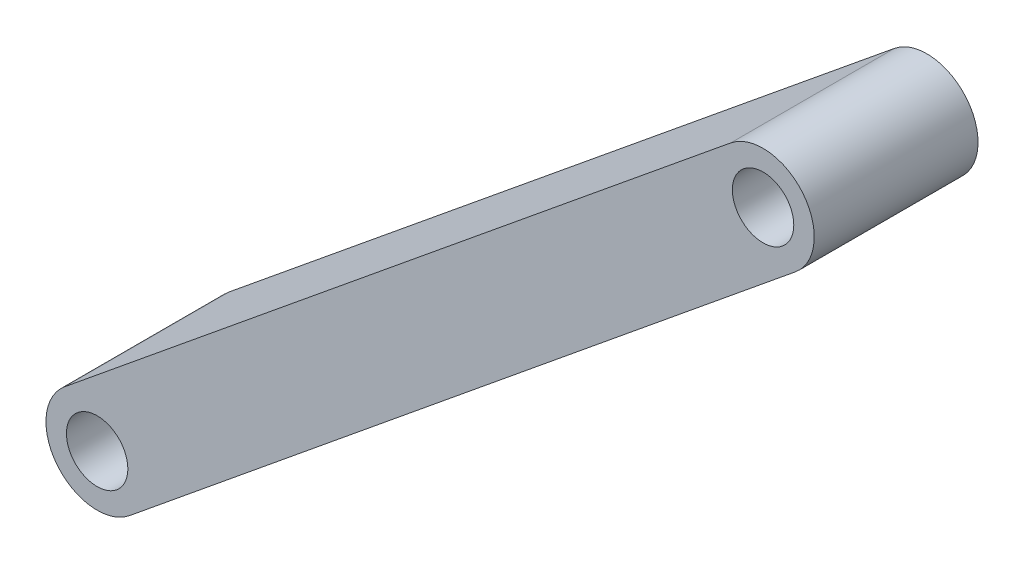
ISO-10303-21;
HEADER;
FILE_DESCRIPTION(('STEP AP214'),'2;1');
FILE_NAME('part.step','',(''),(''),'','','');
FILE_SCHEMA(('AUTOMOTIVE_DESIGN { 1 0 10303 214 1 1 1 1 }'));
ENDSEC;
DATA;
#1=APPLICATION_CONTEXT('core data for automotive mechanical design processes');
#2=APPLICATION_PROTOCOL_DEFINITION('international standard','automotive_design',2000,#1);
#3=PRODUCT_CONTEXT('',#1,'mechanical');
#4=PRODUCT('Part','Part','',(#3));
#5=PRODUCT_RELATED_PRODUCT_CATEGORY('part','',(#4));
#6=PRODUCT_DEFINITION_FORMATION('','',#4);
#7=PRODUCT_DEFINITION_CONTEXT('part definition',#1,'design');
#8=PRODUCT_DEFINITION('design','',#6,#7);
#9=PRODUCT_DEFINITION_SHAPE('','',#8);
#10=(LENGTH_UNIT() NAMED_UNIT(*) SI_UNIT(.MILLI.,.METRE.));
#11=(NAMED_UNIT(*) PLANE_ANGLE_UNIT() SI_UNIT($,.RADIAN.));
#12=(NAMED_UNIT(*) SI_UNIT($,.STERADIAN.) SOLID_ANGLE_UNIT());
#13=UNCERTAINTY_MEASURE_WITH_UNIT(LENGTH_MEASURE(1.E-05),#10,'distance_accuracy_value','');
#14=(GEOMETRIC_REPRESENTATION_CONTEXT(3) GLOBAL_UNCERTAINTY_ASSIGNED_CONTEXT((#13)) GLOBAL_UNIT_ASSIGNED_CONTEXT((#10,
#11,#12)) REPRESENTATION_CONTEXT('',''));
#15=CARTESIAN_POINT('',(0.,0.,0.));
#16=DIRECTION('',(0.,0.,1.));
#17=DIRECTION('',(1.,0.,0.));
#18=AXIS2_PLACEMENT_3D('',#15,#16,#17);
#19=CARTESIAN_POINT('',(-27.9562742549118,16.5739774883447,4.));
#20=DIRECTION('',(0.,0.,1.));
#21=DIRECTION('',(1.,0.,0.));
#22=AXIS2_PLACEMENT_3D('',#19,#20,#21);
#23=PLANE('',#22);
#24=CARTESIAN_POINT('',(-27.9562742549118,16.5739774883447,4.));
#25=DIRECTION('',(0.,0.,1.));
#26=DIRECTION('',(1.,0.,0.));
#27=AXIS2_PLACEMENT_3D('',#24,#25,#26);
#28=CIRCLE('',#27,1.5);
#29=CARTESIAN_POINT('',(-26.4562742549118,16.5739774883447,4.));
#30=VERTEX_POINT('',#29);
#31=EDGE_CURVE('E108',#30,#30,#28,.T.);
#32=ORIENTED_EDGE('',*,*,#31,.F.);
#33=EDGE_LOOP('',(#32));
#34=FACE_BOUND('',#33,.T.);
#35=CARTESIAN_POINT('',(-27.9562742549118,16.5739774883447,4.));
#36=DIRECTION('',(0.,0.,1.));
#37=DIRECTION('',(1.,0.,0.));
#38=AXIS2_PLACEMENT_3D('',#35,#36,#37);
#39=CIRCLE('',#38,2.50000000000001);
#40=CARTESIAN_POINT('',(-26.3744898806056,14.6380130792708,4.));
#41=VERTEX_POINT('',#40);
#42=CARTESIAN_POINT('',(-29.538058629218,18.5099418974185,4.));
#43=VERTEX_POINT('',#42);
#44=EDGE_CURVE('E93',#41,#43,#39,.T.);
#45=ORIENTED_EDGE('',*,*,#44,.T.);
#46=DIRECTION('',(-0.774385763629539,-0.632713749722492,0.));
#47=VECTOR('',#46,1.);
#48=CARTESIAN_POINT('',(-29.538058629218,18.5099418974185,4.));
#49=LINE('',#48,#47);
#50=CARTESIAN_POINT('',(-62.0622607016587,-8.06403559092615,4.));
#51=VERTEX_POINT('',#50);
#52=EDGE_CURVE('E88',#43,#51,#49,.T.);
#53=ORIENTED_EDGE('',*,*,#52,.T.);
#54=CARTESIAN_POINT('',(-60.4804763273524,-10.,4.));
#55=DIRECTION('',(0.,0.,1.));
#56=DIRECTION('',(1.,0.,0.));
#57=AXIS2_PLACEMENT_3D('',#54,#55,#56);
#58=CIRCLE('',#57,2.50000000000001);
#59=CARTESIAN_POINT('',(-58.8986919530462,-11.9359644090739,4.));
#60=VERTEX_POINT('',#59);
#61=EDGE_CURVE('E91',#51,#60,#58,.T.);
#62=ORIENTED_EDGE('',*,*,#61,.T.);
#63=DIRECTION('',(0.774385763629539,0.632713749722492,0.));
#64=VECTOR('',#63,1.);
#65=CARTESIAN_POINT('',(-26.3744898806056,14.6380130792708,4.));
#66=LINE('',#65,#64);
#67=EDGE_CURVE('E58',#60,#41,#66,.T.);
#68=ORIENTED_EDGE('',*,*,#67,.T.);
#69=EDGE_LOOP('',(#45,#53,#62,#68));
#70=FACE_BOUND('',#69,.T.);
#71=CARTESIAN_POINT('',(-60.4804763273524,-10.,4.));
#72=DIRECTION('',(0.,0.,1.));
#73=DIRECTION('',(1.,0.,0.));
#74=AXIS2_PLACEMENT_3D('',#71,#72,#73);
#75=CIRCLE('',#74,1.5);
#76=CARTESIAN_POINT('',(-58.9804763273524,-10.,4.));
#77=VERTEX_POINT('',#76);
#78=EDGE_CURVE('E123',#77,#77,#75,.T.);
#79=ORIENTED_EDGE('',*,*,#78,.F.);
#80=EDGE_LOOP('',(#79));
#81=FACE_BOUND('',#80,.T.);
#82=ADVANCED_FACE('F41',(#34,#70,#81),#23,.T.);
#83=CARTESIAN_POINT('',(-27.9562742549118,16.5739774883447,-4.));
#84=DIRECTION('',(0.,0.,1.));
#85=DIRECTION('',(1.,0.,0.));
#86=AXIS2_PLACEMENT_3D('',#83,#84,#85);
#87=PLANE('',#86);
#88=CARTESIAN_POINT('',(-27.9562742549118,16.5739774883447,-4.));
#89=DIRECTION('',(0.,0.,1.));
#90=DIRECTION('',(1.,0.,0.));
#91=AXIS2_PLACEMENT_3D('',#88,#89,#90);
#92=CIRCLE('',#91,2.50000000000001);
#93=CARTESIAN_POINT('',(-26.3744898806056,14.6380130792708,-4.));
#94=VERTEX_POINT('',#93);
#95=CARTESIAN_POINT('',(-29.538058629218,18.5099418974185,-4.));
#96=VERTEX_POINT('',#95);
#97=EDGE_CURVE('E105',#94,#96,#92,.T.);
#98=ORIENTED_EDGE('',*,*,#97,.F.);
#99=DIRECTION('',(0.774385763629539,0.632713749722492,0.));
#100=VECTOR('',#99,1.);
#101=CARTESIAN_POINT('',(-26.3744898806056,14.6380130792708,-4.));
#102=LINE('',#101,#100);
#103=CARTESIAN_POINT('',(-58.8986919530462,-11.9359644090739,-4.));
#104=VERTEX_POINT('',#103);
#105=EDGE_CURVE('E81',#104,#94,#102,.T.);
#106=ORIENTED_EDGE('',*,*,#105,.F.);
#107=CARTESIAN_POINT('',(-60.4804763273524,-10.,-4.));
#108=DIRECTION('',(0.,0.,1.));
#109=DIRECTION('',(1.,0.,0.));
#110=AXIS2_PLACEMENT_3D('',#107,#108,#109);
#111=CIRCLE('',#110,2.50000000000001);
#112=CARTESIAN_POINT('',(-62.0622607016587,-8.06403559092615,-4.));
#113=VERTEX_POINT('',#112);
#114=EDGE_CURVE('E75',#113,#104,#111,.T.);
#115=ORIENTED_EDGE('',*,*,#114,.F.);
#116=DIRECTION('',(-0.774385763629539,-0.632713749722492,0.));
#117=VECTOR('',#116,1.);
#118=CARTESIAN_POINT('',(-29.538058629218,18.5099418974185,-4.));
#119=LINE('',#118,#117);
#120=EDGE_CURVE('E97',#96,#113,#119,.T.);
#121=ORIENTED_EDGE('',*,*,#120,.F.);
#122=EDGE_LOOP('',(#98,#106,#115,#121));
#123=FACE_BOUND('',#122,.T.);
#124=CARTESIAN_POINT('',(-27.9562742549118,16.5739774883447,-4.));
#125=DIRECTION('',(0.,0.,1.));
#126=DIRECTION('',(1.,0.,0.));
#127=AXIS2_PLACEMENT_3D('',#124,#125,#126);
#128=CIRCLE('',#127,1.5);
#129=CARTESIAN_POINT('',(-26.4562742549118,16.5739774883447,-4.));
#130=VERTEX_POINT('',#129);
#131=EDGE_CURVE('E120',#130,#130,#128,.T.);
#132=ORIENTED_EDGE('',*,*,#131,.T.);
#133=EDGE_LOOP('',(#132));
#134=FACE_BOUND('',#133,.T.);
#135=CARTESIAN_POINT('',(-60.4804763273524,-10.,-4.));
#136=DIRECTION('',(0.,0.,1.));
#137=DIRECTION('',(1.,0.,0.));
#138=AXIS2_PLACEMENT_3D('',#135,#136,#137);
#139=CIRCLE('',#138,1.5);
#140=CARTESIAN_POINT('',(-58.9804763273524,-10.,-4.));
#141=VERTEX_POINT('',#140);
#142=EDGE_CURVE('E126',#141,#141,#139,.T.);
#143=ORIENTED_EDGE('',*,*,#142,.T.);
#144=EDGE_LOOP('',(#143));
#145=FACE_BOUND('',#144,.T.);
#146=ADVANCED_FACE('F116',(#123,#134,#145),#87,.F.);
#147=CARTESIAN_POINT('',(-27.9562742549118,16.5739774883447,4.));
#148=DIRECTION('',(0.,0.,-1.));
#149=DIRECTION('',(-1.,0.,0.));
#150=AXIS2_PLACEMENT_3D('',#147,#148,#149);
#151=CYLINDRICAL_SURFACE('',#150,2.50000000000001);
#152=ORIENTED_EDGE('',*,*,#97,.T.);
#153=DIRECTION('',(0.,0.,-1.));
#154=VECTOR('',#153,1.);
#155=CARTESIAN_POINT('',(-29.538058629218,18.5099418974185,4.));
#156=LINE('',#155,#154);
#157=EDGE_CURVE('E11',#43,#96,#156,.T.);
#158=ORIENTED_EDGE('',*,*,#157,.F.);
#159=ORIENTED_EDGE('',*,*,#44,.F.);
#160=DIRECTION('',(0.,0.,-1.));
#161=VECTOR('',#160,1.);
#162=CARTESIAN_POINT('',(-26.3744898806056,14.6380130792708,4.));
#163=LINE('',#162,#161);
#164=EDGE_CURVE('E101',#41,#94,#163,.T.);
#165=ORIENTED_EDGE('',*,*,#164,.T.);
#166=EDGE_LOOP('',(#152,#158,#159,#165));
#167=FACE_BOUND('',#166,.T.);
#168=ADVANCED_FACE('F43',(#167),#151,.T.);
#169=CARTESIAN_POINT('',(-29.538058629218,18.5099418974185,4.));
#170=DIRECTION('',(0.632713749722492,-0.774385763629539,0.));
#171=DIRECTION('',(0.774385763629539,0.632713749722492,0.));
#172=AXIS2_PLACEMENT_3D('',#169,#170,#171);
#173=PLANE('',#172);
#174=ORIENTED_EDGE('',*,*,#120,.T.);
#175=DIRECTION('',(0.,0.,-1.));
#176=VECTOR('',#175,1.);
#177=CARTESIAN_POINT('',(-62.0622607016587,-8.06403559092615,4.));
#178=LINE('',#177,#176);
#179=EDGE_CURVE('E50',#51,#113,#178,.T.);
#180=ORIENTED_EDGE('',*,*,#179,.F.);
#181=ORIENTED_EDGE('',*,*,#52,.F.);
#182=ORIENTED_EDGE('',*,*,#157,.T.);
#183=EDGE_LOOP('',(#174,#180,#181,#182));
#184=FACE_BOUND('',#183,.T.);
#185=ADVANCED_FACE('F96',(#184),#173,.F.);
#186=CARTESIAN_POINT('',(-60.4804763273524,-10.,4.));
#187=DIRECTION('',(0.,0.,-1.));
#188=DIRECTION('',(-1.,0.,0.));
#189=AXIS2_PLACEMENT_3D('',#186,#187,#188);
#190=CYLINDRICAL_SURFACE('',#189,2.50000000000001);
#191=ORIENTED_EDGE('',*,*,#114,.T.);
#192=DIRECTION('',(0.,0.,-1.));
#193=VECTOR('',#192,1.);
#194=CARTESIAN_POINT('',(-58.8986919530462,-11.9359644090739,4.));
#195=LINE('',#194,#193);
#196=EDGE_CURVE('E98',#60,#104,#195,.T.);
#197=ORIENTED_EDGE('',*,*,#196,.F.);
#198=ORIENTED_EDGE('',*,*,#61,.F.);
#199=ORIENTED_EDGE('',*,*,#179,.T.);
#200=EDGE_LOOP('',(#191,#197,#198,#199));
#201=FACE_BOUND('',#200,.T.);
#202=ADVANCED_FACE('F99',(#201),#190,.T.);
#203=CARTESIAN_POINT('',(-26.3744898806056,14.6380130792708,4.));
#204=DIRECTION('',(-0.632713749722492,0.774385763629539,0.));
#205=DIRECTION('',(-0.774385763629539,-0.632713749722492,0.));
#206=AXIS2_PLACEMENT_3D('',#203,#204,#205);
#207=PLANE('',#206);
#208=ORIENTED_EDGE('',*,*,#105,.T.);
#209=ORIENTED_EDGE('',*,*,#164,.F.);
#210=ORIENTED_EDGE('',*,*,#67,.F.);
#211=ORIENTED_EDGE('',*,*,#196,.T.);
#212=EDGE_LOOP('',(#208,#209,#210,#211));
#213=FACE_BOUND('',#212,.T.);
#214=ADVANCED_FACE('F113',(#213),#207,.F.);
#215=CARTESIAN_POINT('',(-27.9562742549118,16.5739774883447,4.));
#216=DIRECTION('',(0.,0.,-1.));
#217=DIRECTION('',(-1.,0.,0.));
#218=AXIS2_PLACEMENT_3D('',#215,#216,#217);
#219=CYLINDRICAL_SURFACE('',#218,1.5);
#220=ORIENTED_EDGE('',*,*,#31,.T.);
#221=EDGE_LOOP('',(#220));
#222=FACE_BOUND('',#221,.T.);
#223=ORIENTED_EDGE('',*,*,#131,.F.);
#224=EDGE_LOOP('',(#223));
#225=FACE_BOUND('',#224,.T.);
#226=ADVANCED_FACE('F143',(#222,#225),#219,.F.);
#227=CARTESIAN_POINT('',(-60.4804763273524,-10.,4.));
#228=DIRECTION('',(0.,0.,-1.));
#229=DIRECTION('',(-1.,0.,0.));
#230=AXIS2_PLACEMENT_3D('',#227,#228,#229);
#231=CYLINDRICAL_SURFACE('',#230,1.5);
#232=ORIENTED_EDGE('',*,*,#78,.T.);
#233=EDGE_LOOP('',(#232));
#234=FACE_BOUND('',#233,.T.);
#235=ORIENTED_EDGE('',*,*,#142,.F.);
#236=EDGE_LOOP('',(#235));
#237=FACE_BOUND('',#236,.T.);
#238=ADVANCED_FACE('F132',(#234,#237),#231,.F.);
#239=CLOSED_SHELL('',(#82,#146,#168,#185,#202,#214,#226,#238));
#240=MANIFOLD_SOLID_BREP('B2',#239);
#241=ADVANCED_BREP_SHAPE_REPRESENTATION('',(#18,#240),#14);
#242=SHAPE_DEFINITION_REPRESENTATION(#9,#241);
ENDSEC;
END-ISO-10303-21;
